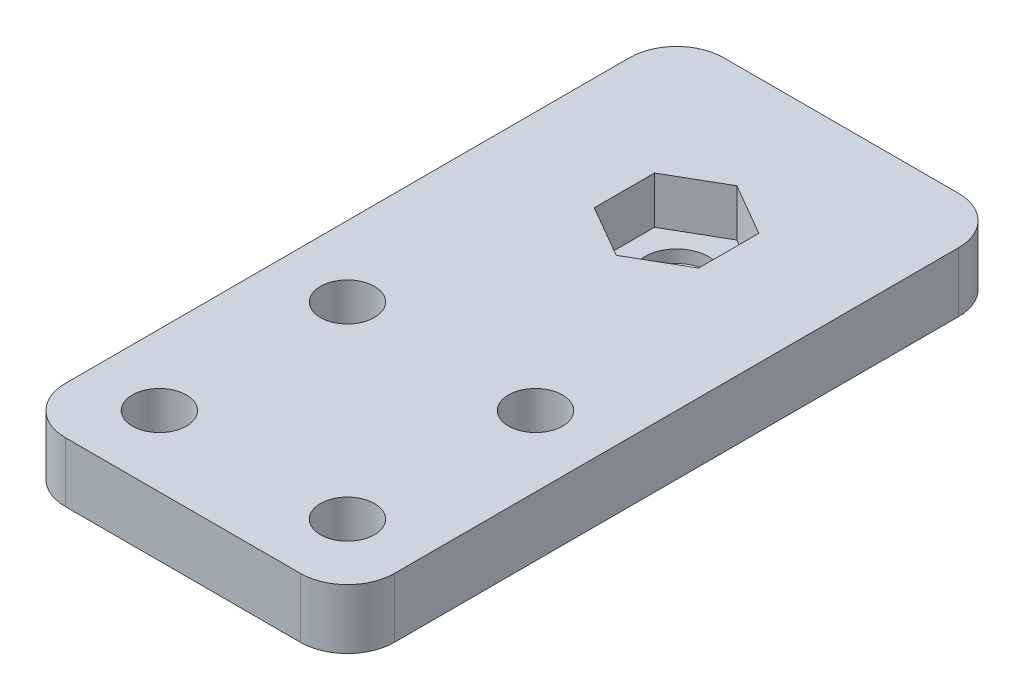
ISO-10303-21;
HEADER;
FILE_DESCRIPTION(('STEP AP214'),'2;1');
FILE_NAME('part.step','',(''),(''),'','','');
FILE_SCHEMA(('AUTOMOTIVE_DESIGN { 1 0 10303 214 1 1 1 1 }'));
ENDSEC;
DATA;
#1=APPLICATION_CONTEXT('core data for automotive mechanical design processes');
#2=APPLICATION_PROTOCOL_DEFINITION('international standard','automotive_design',2000,#1);
#3=PRODUCT_CONTEXT('',#1,'mechanical');
#4=PRODUCT('Part','Part','',(#3));
#5=PRODUCT_RELATED_PRODUCT_CATEGORY('part','',(#4));
#6=PRODUCT_DEFINITION_FORMATION('','',#4);
#7=PRODUCT_DEFINITION_CONTEXT('part definition',#1,'design');
#8=PRODUCT_DEFINITION('design','',#6,#7);
#9=PRODUCT_DEFINITION_SHAPE('','',#8);
#10=(LENGTH_UNIT() NAMED_UNIT(*) SI_UNIT(.MILLI.,.METRE.));
#11=(NAMED_UNIT(*) PLANE_ANGLE_UNIT() SI_UNIT($,.RADIAN.));
#12=(NAMED_UNIT(*) SI_UNIT($,.STERADIAN.) SOLID_ANGLE_UNIT());
#13=UNCERTAINTY_MEASURE_WITH_UNIT(LENGTH_MEASURE(1.E-05),#10,'distance_accuracy_value','');
#14=(GEOMETRIC_REPRESENTATION_CONTEXT(3) GLOBAL_UNCERTAINTY_ASSIGNED_CONTEXT((#13)) GLOBAL_UNIT_ASSIGNED_CONTEXT((#10,
#11,#12)) REPRESENTATION_CONTEXT('',''));
#15=CARTESIAN_POINT('',(0.,0.,0.));
#16=DIRECTION('',(0.,0.,1.));
#17=DIRECTION('',(1.,0.,0.));
#18=AXIS2_PLACEMENT_3D('',#15,#16,#17);
#19=CARTESIAN_POINT('',(-5.5499,6.35,-49.29564827097));
#20=DIRECTION('',(-0.500000000000017,0.,0.866025403784429));
#21=DIRECTION('',(0.866025403784429,0.,0.500000000000017));
#22=AXIS2_PLACEMENT_3D('',#19,#20,#21);
#23=PLANE('',#22);
#24=DIRECTION('',(0.866025403784811,0.,0.499999999999356));
#25=VECTOR('',#24,1.);
#26=CARTESIAN_POINT('',(-5.5499,1.35,-49.29564827097));
#27=LINE('',#26,#25);
#28=CARTESIAN_POINT('',(-5.5499,1.35,-49.29564827097));
#29=VERTEX_POINT('',#28);
#30=CARTESIAN_POINT('',(-1.22151637763079E-12,1.35,-46.0914120119979));
#31=VERTEX_POINT('',#30);
#32=EDGE_CURVE('E315',#29,#31,#27,.T.);
#33=ORIENTED_EDGE('',*,*,#32,.F.);
#34=DIRECTION('',(0.,1.,0.));
#35=VECTOR('',#34,1.);
#36=CARTESIAN_POINT('',(-5.5499,6.35,-49.29564827097));
#37=LINE('',#36,#35);
#38=CARTESIAN_POINT('',(-5.5499,6.35,-49.29564827097));
#39=VERTEX_POINT('',#38);
#40=EDGE_CURVE('E216',#29,#39,#37,.T.);
#41=ORIENTED_EDGE('',*,*,#40,.T.);
#42=DIRECTION('',(-0.866025403784811,0.,-0.499999999999356));
#43=VECTOR('',#42,1.);
#44=CARTESIAN_POINT('',(0.,6.35,-46.091412012));
#45=LINE('',#44,#43);
#46=CARTESIAN_POINT('',(-1.22155381507344E-12,6.35,-46.0914120119979));
#47=VERTEX_POINT('',#46);
#48=EDGE_CURVE('E310',#47,#39,#45,.T.);
#49=ORIENTED_EDGE('',*,*,#48,.F.);
#50=DIRECTION('',(0.,1.,0.));
#51=VECTOR('',#50,1.);
#52=CARTESIAN_POINT('',(0.,6.35,-46.091412012));
#53=LINE('',#52,#51);
#54=EDGE_CURVE('E162',#47,#31,#53,.F.);
#55=ORIENTED_EDGE('',*,*,#54,.T.);
#56=EDGE_LOOP('',(#33,#41,#49,#55));
#57=FACE_BOUND('',#56,.T.);
#58=ADVANCED_FACE('F17',(#57),#23,.F.);
#59=CARTESIAN_POINT('',(-5.5499,6.35,-55.70435172903));
#60=DIRECTION('',(-1.,0.,0.));
#61=DIRECTION('',(0.,0.,1.));
#62=AXIS2_PLACEMENT_3D('',#59,#60,#61);
#63=PLANE('',#62);
#64=DIRECTION('',(0.,0.,1.));
#65=VECTOR('',#64,1.);
#66=CARTESIAN_POINT('',(-5.5499,1.35,0.));
#67=LINE('',#66,#65);
#68=CARTESIAN_POINT('',(-5.54989999999878,1.35,-55.7043517290279));
#69=VERTEX_POINT('',#68);
#70=EDGE_CURVE('E184',#69,#29,#67,.T.);
#71=ORIENTED_EDGE('',*,*,#70,.F.);
#72=DIRECTION('',(0.,1.,0.));
#73=VECTOR('',#72,1.);
#74=CARTESIAN_POINT('',(-5.54989999999756,6.35,-55.7043517290258));
#75=LINE('',#74,#73);
#76=CARTESIAN_POINT('',(-5.54989999999939,6.35,-55.704351729029));
#77=VERTEX_POINT('',#76);
#78=EDGE_CURVE('E212',#69,#77,#75,.T.);
#79=ORIENTED_EDGE('',*,*,#78,.T.);
#80=DIRECTION('',(0.,0.,1.));
#81=VECTOR('',#80,1.);
#82=CARTESIAN_POINT('',(-5.5499,6.35,0.));
#83=LINE('',#82,#81);
#84=EDGE_CURVE('E307',#39,#77,#83,.F.);
#85=ORIENTED_EDGE('',*,*,#84,.F.);
#86=ORIENTED_EDGE('',*,*,#40,.F.);
#87=EDGE_LOOP('',(#71,#79,#85,#86));
#88=FACE_BOUND('',#87,.T.);
#89=ADVANCED_FACE('F331',(#88),#63,.F.);
#90=CARTESIAN_POINT('',(0.,6.35,-58.908587988));
#91=DIRECTION('',(-0.500000000000017,0.,-0.866025403784429));
#92=DIRECTION('',(-0.866025403784429,0.,0.500000000000017));
#93=AXIS2_PLACEMENT_3D('',#90,#91,#92);
#94=PLANE('',#93);
#95=DIRECTION('',(-0.866025403784811,0.,0.499999999999356));
#96=VECTOR('',#95,1.);
#97=CARTESIAN_POINT('',(0.,1.35,-58.908587988));
#98=LINE('',#97,#96);
#99=CARTESIAN_POINT('',(1.22151637763079E-12,1.35,-58.9085879880021));
#100=VERTEX_POINT('',#99);
#101=EDGE_CURVE('E180',#100,#69,#98,.T.);
#102=ORIENTED_EDGE('',*,*,#101,.F.);
#103=DIRECTION('',(0.,1.,0.));
#104=VECTOR('',#103,1.);
#105=CARTESIAN_POINT('',(2.44422537765132E-12,6.35,-58.9085879880042));
#106=LINE('',#105,#104);
#107=CARTESIAN_POINT('',(6.11327394955952E-13,6.35,-58.9085879880011));
#108=VERTEX_POINT('',#107);
#109=EDGE_CURVE('E163',#100,#108,#106,.T.);
#110=ORIENTED_EDGE('',*,*,#109,.T.);
#111=DIRECTION('',(0.866025403784811,0.,-0.499999999999356));
#112=VECTOR('',#111,1.);
#113=CARTESIAN_POINT('',(-5.5499,6.35,-55.70435172903));
#114=LINE('',#113,#112);
#115=EDGE_CURVE('E304',#77,#108,#114,.T.);
#116=ORIENTED_EDGE('',*,*,#115,.F.);
#117=ORIENTED_EDGE('',*,*,#78,.F.);
#118=EDGE_LOOP('',(#102,#110,#116,#117));
#119=FACE_BOUND('',#118,.T.);
#120=ADVANCED_FACE('F333',(#119),#94,.F.);
#121=CARTESIAN_POINT('',(5.5499,6.35,-55.70435172903));
#122=DIRECTION('',(0.500000000000017,0.,-0.866025403784429));
#123=DIRECTION('',(-0.866025403784429,0.,-0.500000000000017));
#124=AXIS2_PLACEMENT_3D('',#121,#122,#123);
#125=PLANE('',#124);
#126=DIRECTION('',(-0.866025403784811,0.,-0.499999999999356));
#127=VECTOR('',#126,1.);
#128=CARTESIAN_POINT('',(5.5499,1.35,-55.70435172903));
#129=LINE('',#128,#127);
#130=CARTESIAN_POINT('',(5.5499,1.35,-55.70435172903));
#131=VERTEX_POINT('',#130);
#132=EDGE_CURVE('E170',#131,#100,#129,.T.);
#133=ORIENTED_EDGE('',*,*,#132,.F.);
#134=DIRECTION('',(0.,1.,0.));
#135=VECTOR('',#134,1.);
#136=CARTESIAN_POINT('',(5.5499,6.35,-55.70435172903));
#137=LINE('',#136,#135);
#138=CARTESIAN_POINT('',(5.5499,6.35,-55.70435172903));
#139=VERTEX_POINT('',#138);
#140=EDGE_CURVE('E154',#131,#139,#137,.T.);
#141=ORIENTED_EDGE('',*,*,#140,.T.);
#142=DIRECTION('',(0.866025403784811,0.,0.499999999999356));
#143=VECTOR('',#142,1.);
#144=CARTESIAN_POINT('',(0.,6.35,-58.908587988));
#145=LINE('',#144,#143);
#146=EDGE_CURVE('E301',#108,#139,#145,.T.);
#147=ORIENTED_EDGE('',*,*,#146,.F.);
#148=ORIENTED_EDGE('',*,*,#109,.F.);
#149=EDGE_LOOP('',(#133,#141,#147,#148));
#150=FACE_BOUND('',#149,.T.);
#151=ADVANCED_FACE('F177',(#150),#125,.F.);
#152=CARTESIAN_POINT('',(5.5499,6.35,-49.29564827097));
#153=DIRECTION('',(1.,0.,0.));
#154=DIRECTION('',(0.,0.,-1.));
#155=AXIS2_PLACEMENT_3D('',#152,#153,#154);
#156=PLANE('',#155);
#157=DIRECTION('',(0.,0.,1.));
#158=VECTOR('',#157,1.);
#159=CARTESIAN_POINT('',(5.5499,1.35,0.));
#160=LINE('',#159,#158);
#161=CARTESIAN_POINT('',(5.54989999999939,1.35,-49.2956482709711));
#162=VERTEX_POINT('',#161);
#163=EDGE_CURVE('E157',#162,#131,#160,.F.);
#164=ORIENTED_EDGE('',*,*,#163,.F.);
#165=DIRECTION('',(0.,1.,0.));
#166=VECTOR('',#165,1.);
#167=CARTESIAN_POINT('',(5.54989999999756,6.35,-49.2956482709742));
#168=LINE('',#167,#166);
#169=CARTESIAN_POINT('',(5.54989999999939,6.35,-49.2956482709711));
#170=VERTEX_POINT('',#169);
#171=EDGE_CURVE('E175',#162,#170,#168,.T.);
#172=ORIENTED_EDGE('',*,*,#171,.T.);
#173=DIRECTION('',(0.,0.,1.));
#174=VECTOR('',#173,1.);
#175=CARTESIAN_POINT('',(5.5499,6.35,0.));
#176=LINE('',#175,#174);
#177=EDGE_CURVE('E109',#139,#170,#176,.T.);
#178=ORIENTED_EDGE('',*,*,#177,.F.);
#179=ORIENTED_EDGE('',*,*,#140,.F.);
#180=EDGE_LOOP('',(#164,#172,#178,#179));
#181=FACE_BOUND('',#180,.T.);
#182=ADVANCED_FACE('F156',(#181),#156,.F.);
#183=CARTESIAN_POINT('',(0.,6.35,-46.091412012));
#184=DIRECTION('',(0.500000000000017,0.,0.866025403784429));
#185=DIRECTION('',(0.866025403784429,0.,-0.500000000000017));
#186=AXIS2_PLACEMENT_3D('',#183,#184,#185);
#187=PLANE('',#186);
#188=DIRECTION('',(0.866025403784811,0.,-0.499999999999356));
#189=VECTOR('',#188,1.);
#190=CARTESIAN_POINT('',(0.,1.35,-46.091412012));
#191=LINE('',#190,#189);
#192=EDGE_CURVE('E173',#31,#162,#191,.T.);
#193=ORIENTED_EDGE('',*,*,#192,.F.);
#194=ORIENTED_EDGE('',*,*,#54,.F.);
#195=DIRECTION('',(-0.866025403784811,0.,0.499999999999356));
#196=VECTOR('',#195,1.);
#197=CARTESIAN_POINT('',(5.5499,6.35,-49.29564827097));
#198=LINE('',#197,#196);
#199=EDGE_CURVE('E296',#170,#47,#198,.T.);
#200=ORIENTED_EDGE('',*,*,#199,.F.);
#201=ORIENTED_EDGE('',*,*,#171,.F.);
#202=EDGE_LOOP('',(#193,#194,#200,#201));
#203=FACE_BOUND('',#202,.T.);
#204=ADVANCED_FACE('F327',(#203),#187,.F.);
#205=CARTESIAN_POINT('',(0.,1.35,0.));
#206=DIRECTION('',(0.,1.,0.));
#207=DIRECTION('',(0.,0.,1.));
#208=AXIS2_PLACEMENT_3D('',#205,#206,#207);
#209=PLANE('',#208);
#210=CARTESIAN_POINT('',(0.,1.35,-52.5));
#211=DIRECTION('',(0.,-1.,0.));
#212=DIRECTION('',(0.,0.,-1.));
#213=AXIS2_PLACEMENT_3D('',#210,#211,#212);
#214=CIRCLE('',#213,3.375);
#215=CARTESIAN_POINT('',(0.,1.35,-55.875));
#216=VERTEX_POINT('',#215);
#217=EDGE_CURVE('E259',#216,#216,#214,.T.);
#218=ORIENTED_EDGE('',*,*,#217,.T.);
#219=EDGE_LOOP('',(#218));
#220=FACE_BOUND('',#219,.T.);
#221=ORIENTED_EDGE('',*,*,#32,.T.);
#222=ORIENTED_EDGE('',*,*,#192,.T.);
#223=ORIENTED_EDGE('',*,*,#163,.T.);
#224=ORIENTED_EDGE('',*,*,#132,.T.);
#225=ORIENTED_EDGE('',*,*,#101,.T.);
#226=ORIENTED_EDGE('',*,*,#70,.T.);
#227=EDGE_LOOP('',(#221,#222,#223,#224,#225,#226));
#228=FACE_BOUND('',#227,.T.);
#229=ADVANCED_FACE('F168',(#220,#228),#209,.T.);
#230=CARTESIAN_POINT('',(0.,6.35,0.));
#231=DIRECTION('',(0.,1.,0.));
#232=DIRECTION('',(0.,0.,1.));
#233=AXIS2_PLACEMENT_3D('',#230,#231,#232);
#234=PLANE('',#233);
#235=ORIENTED_EDGE('',*,*,#177,.T.);
#236=ORIENTED_EDGE('',*,*,#199,.T.);
#237=ORIENTED_EDGE('',*,*,#48,.T.);
#238=ORIENTED_EDGE('',*,*,#84,.T.);
#239=ORIENTED_EDGE('',*,*,#115,.T.);
#240=ORIENTED_EDGE('',*,*,#146,.T.);
#241=EDGE_LOOP('',(#235,#236,#237,#238,#239,#240));
#242=FACE_BOUND('',#241,.T.);
#243=CARTESIAN_POINT('',(10.,6.35,-7.5));
#244=DIRECTION('',(0.,-1.,0.));
#245=DIRECTION('',(0.,0.,-1.));
#246=AXIS2_PLACEMENT_3D('',#243,#244,#245);
#247=CIRCLE('',#246,2.875);
#248=CARTESIAN_POINT('',(10.,6.35,-10.375));
#249=VERTEX_POINT('',#248);
#250=EDGE_CURVE('E255',#249,#249,#247,.T.);
#251=ORIENTED_EDGE('',*,*,#250,.T.);
#252=EDGE_LOOP('',(#251));
#253=FACE_BOUND('',#252,.T.);
#254=CARTESIAN_POINT('',(-10.,6.35,-27.5));
#255=DIRECTION('',(0.,-1.,0.));
#256=DIRECTION('',(0.,0.,-1.));
#257=AXIS2_PLACEMENT_3D('',#254,#255,#256);
#258=CIRCLE('',#257,2.875);
#259=CARTESIAN_POINT('',(-10.,6.35,-30.375));
#260=VERTEX_POINT('',#259);
#261=EDGE_CURVE('E263',#260,#260,#258,.T.);
#262=ORIENTED_EDGE('',*,*,#261,.T.);
#263=EDGE_LOOP('',(#262));
#264=FACE_BOUND('',#263,.T.);
#265=CARTESIAN_POINT('',(-10.,6.35,-7.5));
#266=DIRECTION('',(0.,-1.,0.));
#267=DIRECTION('',(0.,0.,-1.));
#268=AXIS2_PLACEMENT_3D('',#265,#266,#267);
#269=CIRCLE('',#268,2.875);
#270=CARTESIAN_POINT('',(-10.,6.35,-10.375));
#271=VERTEX_POINT('',#270);
#272=EDGE_CURVE('E267',#271,#271,#269,.T.);
#273=ORIENTED_EDGE('',*,*,#272,.T.);
#274=EDGE_LOOP('',(#273));
#275=FACE_BOUND('',#274,.T.);
#276=CARTESIAN_POINT('',(10.,6.35,-27.5));
#277=DIRECTION('',(0.,-1.,0.));
#278=DIRECTION('',(0.,0.,-1.));
#279=AXIS2_PLACEMENT_3D('',#276,#277,#278);
#280=CIRCLE('',#279,2.875);
#281=CARTESIAN_POINT('',(10.,6.35,-30.375));
#282=VERTEX_POINT('',#281);
#283=EDGE_CURVE('E271',#282,#282,#280,.T.);
#284=ORIENTED_EDGE('',*,*,#283,.T.);
#285=EDGE_LOOP('',(#284));
#286=FACE_BOUND('',#285,.T.);
#287=DIRECTION('',(1.,0.,0.));
#288=VECTOR('',#287,1.);
#289=CARTESIAN_POINT('',(-17.5,6.35,0.));
#290=LINE('',#289,#288);
#291=CARTESIAN_POINT('',(12.5,6.35,0.));
#292=VERTEX_POINT('',#291);
#293=CARTESIAN_POINT('',(-12.5,6.35,0.));
#294=VERTEX_POINT('',#293);
#295=EDGE_CURVE('E188',#292,#294,#290,.F.);
#296=ORIENTED_EDGE('',*,*,#295,.F.);
#297=CARTESIAN_POINT('',(12.5,6.35,-5.));
#298=DIRECTION('',(0.,-1.,0.));
#299=DIRECTION('',(0.,0.,-1.));
#300=AXIS2_PLACEMENT_3D('',#297,#298,#299);
#301=CIRCLE('',#300,5.);
#302=CARTESIAN_POINT('',(17.5,6.35,-5.));
#303=VERTEX_POINT('',#302);
#304=EDGE_CURVE('E20',#303,#292,#301,.T.);
#305=ORIENTED_EDGE('',*,*,#304,.F.);
#306=DIRECTION('',(0.,0.,-1.));
#307=VECTOR('',#306,1.);
#308=CARTESIAN_POINT('',(17.5,6.35,0.));
#309=LINE('',#308,#307);
#310=CARTESIAN_POINT('',(17.5,6.35,-65.));
#311=VERTEX_POINT('',#310);
#312=EDGE_CURVE('E98',#311,#303,#309,.F.);
#313=ORIENTED_EDGE('',*,*,#312,.F.);
#314=CARTESIAN_POINT('',(12.5,6.35,-65.));
#315=DIRECTION('',(0.,-1.,0.));
#316=DIRECTION('',(0.,0.,-1.));
#317=AXIS2_PLACEMENT_3D('',#314,#315,#316);
#318=CIRCLE('',#317,5.);
#319=CARTESIAN_POINT('',(12.5,6.35,-70.));
#320=VERTEX_POINT('',#319);
#321=EDGE_CURVE('E281',#320,#311,#318,.T.);
#322=ORIENTED_EDGE('',*,*,#321,.F.);
#323=DIRECTION('',(-1.,0.,0.));
#324=VECTOR('',#323,1.);
#325=CARTESIAN_POINT('',(17.5,6.35,-70.));
#326=LINE('',#325,#324);
#327=CARTESIAN_POINT('',(-12.5,6.35,-70.));
#328=VERTEX_POINT('',#327);
#329=EDGE_CURVE('E197',#328,#320,#326,.F.);
#330=ORIENTED_EDGE('',*,*,#329,.F.);
#331=CARTESIAN_POINT('',(-12.5,6.35,-65.));
#332=DIRECTION('',(0.,-1.,0.));
#333=DIRECTION('',(0.,0.,-1.));
#334=AXIS2_PLACEMENT_3D('',#331,#332,#333);
#335=CIRCLE('',#334,5.);
#336=CARTESIAN_POINT('',(-17.5,6.35,-65.));
#337=VERTEX_POINT('',#336);
#338=EDGE_CURVE('E279',#337,#328,#335,.T.);
#339=ORIENTED_EDGE('',*,*,#338,.F.);
#340=DIRECTION('',(0.,0.,1.));
#341=VECTOR('',#340,1.);
#342=CARTESIAN_POINT('',(-17.5,6.35,-70.));
#343=LINE('',#342,#341);
#344=CARTESIAN_POINT('',(-17.5,6.35,-5.));
#345=VERTEX_POINT('',#344);
#346=EDGE_CURVE('E192',#345,#337,#343,.F.);
#347=ORIENTED_EDGE('',*,*,#346,.F.);
#348=CARTESIAN_POINT('',(-12.5,6.35,-5.));
#349=DIRECTION('',(0.,-1.,0.));
#350=DIRECTION('',(0.,0.,-1.));
#351=AXIS2_PLACEMENT_3D('',#348,#349,#350);
#352=CIRCLE('',#351,5.);
#353=EDGE_CURVE('E276',#294,#345,#352,.T.);
#354=ORIENTED_EDGE('',*,*,#353,.F.);
#355=EDGE_LOOP('',(#296,#305,#313,#322,#330,#339,#347,#354));
#356=FACE_BOUND('',#355,.T.);
#357=ADVANCED_FACE('F328',(#242,#253,#264,#275,#286,#356),#234,.T.);
#358=CARTESIAN_POINT('',(12.5,14.62786,-5.));
#359=DIRECTION('',(0.,-1.,0.));
#360=DIRECTION('',(0.,0.,-1.));
#361=AXIS2_PLACEMENT_3D('',#358,#359,#360);
#362=CYLINDRICAL_SURFACE('',#361,5.);
#363=DIRECTION('',(0.,1.,0.));
#364=VECTOR('',#363,1.);
#365=CARTESIAN_POINT('',(12.5,0.,0.));
#366=LINE('',#365,#364);
#367=CARTESIAN_POINT('',(12.5,0.,0.));
#368=VERTEX_POINT('',#367);
#369=EDGE_CURVE('E275',#368,#292,#366,.T.);
#370=ORIENTED_EDGE('',*,*,#369,.F.);
#371=CARTESIAN_POINT('',(12.5,0.,-5.));
#372=DIRECTION('',(0.,-1.,0.));
#373=DIRECTION('',(0.,0.,-1.));
#374=AXIS2_PLACEMENT_3D('',#371,#372,#373);
#375=CIRCLE('',#374,5.);
#376=CARTESIAN_POINT('',(17.5,0.,-5.));
#377=VERTEX_POINT('',#376);
#378=EDGE_CURVE('E251',#368,#377,#375,.F.);
#379=ORIENTED_EDGE('',*,*,#378,.T.);
#380=DIRECTION('',(0.,1.,0.));
#381=VECTOR('',#380,1.);
#382=CARTESIAN_POINT('',(17.5,0.,-5.));
#383=LINE('',#382,#381);
#384=EDGE_CURVE('E204',#303,#377,#383,.F.);
#385=ORIENTED_EDGE('',*,*,#384,.F.);
#386=ORIENTED_EDGE('',*,*,#304,.T.);
#387=EDGE_LOOP('',(#370,#379,#385,#386));
#388=FACE_BOUND('',#387,.T.);
#389=ADVANCED_FACE('F397',(#388),#362,.T.);
#390=CARTESIAN_POINT('',(17.5,0.,0.));
#391=DIRECTION('',(1.,0.,0.));
#392=DIRECTION('',(0.,0.,-1.));
#393=AXIS2_PLACEMENT_3D('',#390,#391,#392);
#394=PLANE('',#393);
#395=ORIENTED_EDGE('',*,*,#312,.T.);
#396=ORIENTED_EDGE('',*,*,#384,.T.);
#397=DIRECTION('',(0.,0.,1.));
#398=VECTOR('',#397,1.);
#399=CARTESIAN_POINT('',(17.5,0.,0.));
#400=LINE('',#399,#398);
#401=CARTESIAN_POINT('',(17.5,0.,-65.));
#402=VERTEX_POINT('',#401);
#403=EDGE_CURVE('E250',#377,#402,#400,.F.);
#404=ORIENTED_EDGE('',*,*,#403,.T.);
#405=DIRECTION('',(0.,-1.,0.));
#406=VECTOR('',#405,1.);
#407=CARTESIAN_POINT('',(17.5,14.62786,-65.));
#408=LINE('',#407,#406);
#409=EDGE_CURVE('E201',#311,#402,#408,.T.);
#410=ORIENTED_EDGE('',*,*,#409,.F.);
#411=EDGE_LOOP('',(#395,#396,#404,#410));
#412=FACE_BOUND('',#411,.T.);
#413=ADVANCED_FACE('F395',(#412),#394,.T.);
#414=CARTESIAN_POINT('',(12.5,14.62786,-65.));
#415=DIRECTION('',(0.,-1.,0.));
#416=DIRECTION('',(0.,0.,-1.));
#417=AXIS2_PLACEMENT_3D('',#414,#415,#416);
#418=CYLINDRICAL_SURFACE('',#417,5.);
#419=ORIENTED_EDGE('',*,*,#409,.T.);
#420=CARTESIAN_POINT('',(12.5,0.,-65.));
#421=DIRECTION('',(0.,-1.,0.));
#422=DIRECTION('',(0.,0.,-1.));
#423=AXIS2_PLACEMENT_3D('',#420,#421,#422);
#424=CIRCLE('',#423,5.);
#425=CARTESIAN_POINT('',(12.5,0.,-70.));
#426=VERTEX_POINT('',#425);
#427=EDGE_CURVE('E246',#402,#426,#424,.F.);
#428=ORIENTED_EDGE('',*,*,#427,.T.);
#429=DIRECTION('',(0.,1.,0.));
#430=VECTOR('',#429,1.);
#431=CARTESIAN_POINT('',(12.5,0.,-70.));
#432=LINE('',#431,#430);
#433=EDGE_CURVE('E200',#320,#426,#432,.F.);
#434=ORIENTED_EDGE('',*,*,#433,.F.);
#435=ORIENTED_EDGE('',*,*,#321,.T.);
#436=EDGE_LOOP('',(#419,#428,#434,#435));
#437=FACE_BOUND('',#436,.T.);
#438=ADVANCED_FACE('F391',(#437),#418,.T.);
#439=CARTESIAN_POINT('',(17.5,0.,-70.));
#440=DIRECTION('',(0.,0.,-1.));
#441=DIRECTION('',(-1.,0.,0.));
#442=AXIS2_PLACEMENT_3D('',#439,#440,#441);
#443=PLANE('',#442);
#444=ORIENTED_EDGE('',*,*,#329,.T.);
#445=ORIENTED_EDGE('',*,*,#433,.T.);
#446=DIRECTION('',(1.,0.,0.));
#447=VECTOR('',#446,1.);
#448=CARTESIAN_POINT('',(0.,0.,-70.));
#449=LINE('',#448,#447);
#450=CARTESIAN_POINT('',(-12.5,0.,-70.));
#451=VERTEX_POINT('',#450);
#452=EDGE_CURVE('E245',#426,#451,#449,.F.);
#453=ORIENTED_EDGE('',*,*,#452,.T.);
#454=DIRECTION('',(0.,-1.,0.));
#455=VECTOR('',#454,1.);
#456=CARTESIAN_POINT('',(-12.5,14.62786,-70.));
#457=LINE('',#456,#455);
#458=EDGE_CURVE('E196',#328,#451,#457,.T.);
#459=ORIENTED_EDGE('',*,*,#458,.F.);
#460=EDGE_LOOP('',(#444,#445,#453,#459));
#461=FACE_BOUND('',#460,.T.);
#462=ADVANCED_FACE('F387',(#461),#443,.T.);
#463=CARTESIAN_POINT('',(-12.5,14.62786,-65.));
#464=DIRECTION('',(0.,-1.,0.));
#465=DIRECTION('',(0.,0.,-1.));
#466=AXIS2_PLACEMENT_3D('',#463,#464,#465);
#467=CYLINDRICAL_SURFACE('',#466,5.);
#468=ORIENTED_EDGE('',*,*,#458,.T.);
#469=CARTESIAN_POINT('',(-12.5,0.,-65.));
#470=DIRECTION('',(0.,-1.,0.));
#471=DIRECTION('',(0.,0.,-1.));
#472=AXIS2_PLACEMENT_3D('',#469,#470,#471);
#473=CIRCLE('',#472,5.);
#474=CARTESIAN_POINT('',(-17.5,0.,-65.));
#475=VERTEX_POINT('',#474);
#476=EDGE_CURVE('E241',#451,#475,#473,.F.);
#477=ORIENTED_EDGE('',*,*,#476,.T.);
#478=DIRECTION('',(0.,1.,0.));
#479=VECTOR('',#478,1.);
#480=CARTESIAN_POINT('',(-17.5,0.,-65.));
#481=LINE('',#480,#479);
#482=EDGE_CURVE('E195',#337,#475,#481,.F.);
#483=ORIENTED_EDGE('',*,*,#482,.F.);
#484=ORIENTED_EDGE('',*,*,#338,.T.);
#485=EDGE_LOOP('',(#468,#477,#483,#484));
#486=FACE_BOUND('',#485,.T.);
#487=ADVANCED_FACE('F383',(#486),#467,.T.);
#488=CARTESIAN_POINT('',(-17.5,0.,-70.));
#489=DIRECTION('',(-1.,0.,0.));
#490=DIRECTION('',(0.,0.,1.));
#491=AXIS2_PLACEMENT_3D('',#488,#489,#490);
#492=PLANE('',#491);
#493=DIRECTION('',(0.,0.,1.));
#494=VECTOR('',#493,1.);
#495=CARTESIAN_POINT('',(-17.5,0.,0.));
#496=LINE('',#495,#494);
#497=CARTESIAN_POINT('',(-17.5,0.,-5.));
#498=VERTEX_POINT('',#497);
#499=EDGE_CURVE('E240',#475,#498,#496,.T.);
#500=ORIENTED_EDGE('',*,*,#499,.T.);
#501=DIRECTION('',(0.,-1.,0.));
#502=VECTOR('',#501,1.);
#503=CARTESIAN_POINT('',(-17.5,14.62786,-5.));
#504=LINE('',#503,#502);
#505=EDGE_CURVE('E191',#345,#498,#504,.T.);
#506=ORIENTED_EDGE('',*,*,#505,.F.);
#507=ORIENTED_EDGE('',*,*,#346,.T.);
#508=ORIENTED_EDGE('',*,*,#482,.T.);
#509=EDGE_LOOP('',(#500,#506,#507,#508));
#510=FACE_BOUND('',#509,.T.);
#511=ADVANCED_FACE('F379',(#510),#492,.T.);
#512=CARTESIAN_POINT('',(-12.5,14.62786,-5.));
#513=DIRECTION('',(0.,-1.,0.));
#514=DIRECTION('',(0.,0.,-1.));
#515=AXIS2_PLACEMENT_3D('',#512,#513,#514);
#516=CYLINDRICAL_SURFACE('',#515,5.);
#517=ORIENTED_EDGE('',*,*,#505,.T.);
#518=CARTESIAN_POINT('',(-12.5,0.,-5.));
#519=DIRECTION('',(0.,-1.,0.));
#520=DIRECTION('',(0.,0.,-1.));
#521=AXIS2_PLACEMENT_3D('',#518,#519,#520);
#522=CIRCLE('',#521,5.);
#523=CARTESIAN_POINT('',(-12.5,0.,0.));
#524=VERTEX_POINT('',#523);
#525=EDGE_CURVE('E236',#498,#524,#522,.F.);
#526=ORIENTED_EDGE('',*,*,#525,.T.);
#527=DIRECTION('',(0.,1.,0.));
#528=VECTOR('',#527,1.);
#529=CARTESIAN_POINT('',(-12.5,0.,0.));
#530=LINE('',#529,#528);
#531=EDGE_CURVE('E39',#294,#524,#530,.F.);
#532=ORIENTED_EDGE('',*,*,#531,.F.);
#533=ORIENTED_EDGE('',*,*,#353,.T.);
#534=EDGE_LOOP('',(#517,#526,#532,#533));
#535=FACE_BOUND('',#534,.T.);
#536=ADVANCED_FACE('F376',(#535),#516,.T.);
#537=CARTESIAN_POINT('',(-17.5,0.,0.));
#538=DIRECTION('',(0.,0.,1.));
#539=DIRECTION('',(1.,0.,0.));
#540=AXIS2_PLACEMENT_3D('',#537,#538,#539);
#541=PLANE('',#540);
#542=DIRECTION('',(1.,0.,0.));
#543=VECTOR('',#542,1.);
#544=CARTESIAN_POINT('',(0.,0.,0.));
#545=LINE('',#544,#543);
#546=EDGE_CURVE('E235',#524,#368,#545,.T.);
#547=ORIENTED_EDGE('',*,*,#546,.T.);
#548=ORIENTED_EDGE('',*,*,#369,.T.);
#549=ORIENTED_EDGE('',*,*,#295,.T.);
#550=ORIENTED_EDGE('',*,*,#531,.T.);
#551=EDGE_LOOP('',(#547,#548,#549,#550));
#552=FACE_BOUND('',#551,.T.);
#553=ADVANCED_FACE('F372',(#552),#541,.T.);
#554=CARTESIAN_POINT('',(10.,6.35,-27.5));
#555=DIRECTION('',(0.,-1.,0.));
#556=DIRECTION('',(0.,0.,-1.));
#557=AXIS2_PLACEMENT_3D('',#554,#555,#556);
#558=CYLINDRICAL_SURFACE('',#557,2.875);
#559=ORIENTED_EDGE('',*,*,#283,.F.);
#560=EDGE_LOOP('',(#559));
#561=FACE_BOUND('',#560,.T.);
#562=CARTESIAN_POINT('',(10.,0.,-27.5));
#563=DIRECTION('',(0.,-1.,0.));
#564=DIRECTION('',(0.,0.,-1.));
#565=AXIS2_PLACEMENT_3D('',#562,#563,#564);
#566=CIRCLE('',#565,2.875);
#567=CARTESIAN_POINT('',(10.,0.,-30.375));
#568=VERTEX_POINT('',#567);
#569=EDGE_CURVE('E231',#568,#568,#566,.T.);
#570=ORIENTED_EDGE('',*,*,#569,.T.);
#571=EDGE_LOOP('',(#570));
#572=FACE_BOUND('',#571,.T.);
#573=ADVANCED_FACE('F368',(#561,#572),#558,.F.);
#574=CARTESIAN_POINT('',(-10.,6.35,-7.5));
#575=DIRECTION('',(0.,-1.,0.));
#576=DIRECTION('',(0.,0.,-1.));
#577=AXIS2_PLACEMENT_3D('',#574,#575,#576);
#578=CYLINDRICAL_SURFACE('',#577,2.875);
#579=ORIENTED_EDGE('',*,*,#272,.F.);
#580=EDGE_LOOP('',(#579));
#581=FACE_BOUND('',#580,.T.);
#582=CARTESIAN_POINT('',(-10.,0.,-7.5));
#583=DIRECTION('',(0.,-1.,0.));
#584=DIRECTION('',(0.,0.,-1.));
#585=AXIS2_PLACEMENT_3D('',#582,#583,#584);
#586=CIRCLE('',#585,2.875);
#587=CARTESIAN_POINT('',(-10.,0.,-10.375));
#588=VERTEX_POINT('',#587);
#589=EDGE_CURVE('E227',#588,#588,#586,.T.);
#590=ORIENTED_EDGE('',*,*,#589,.T.);
#591=EDGE_LOOP('',(#590));
#592=FACE_BOUND('',#591,.T.);
#593=ADVANCED_FACE('F364',(#581,#592),#578,.F.);
#594=CARTESIAN_POINT('',(-10.,6.35,-27.5));
#595=DIRECTION('',(0.,-1.,0.));
#596=DIRECTION('',(0.,0.,-1.));
#597=AXIS2_PLACEMENT_3D('',#594,#595,#596);
#598=CYLINDRICAL_SURFACE('',#597,2.875);
#599=ORIENTED_EDGE('',*,*,#261,.F.);
#600=EDGE_LOOP('',(#599));
#601=FACE_BOUND('',#600,.T.);
#602=CARTESIAN_POINT('',(-10.,0.,-27.5));
#603=DIRECTION('',(0.,-1.,0.));
#604=DIRECTION('',(0.,0.,-1.));
#605=AXIS2_PLACEMENT_3D('',#602,#603,#604);
#606=CIRCLE('',#605,2.875);
#607=CARTESIAN_POINT('',(-10.,0.,-30.375));
#608=VERTEX_POINT('',#607);
#609=EDGE_CURVE('E223',#608,#608,#606,.T.);
#610=ORIENTED_EDGE('',*,*,#609,.T.);
#611=EDGE_LOOP('',(#610));
#612=FACE_BOUND('',#611,.T.);
#613=ADVANCED_FACE('F360',(#601,#612),#598,.F.);
#614=CARTESIAN_POINT('',(0.,6.35,-52.5));
#615=DIRECTION('',(0.,-1.,0.));
#616=DIRECTION('',(0.,0.,-1.));
#617=AXIS2_PLACEMENT_3D('',#614,#615,#616);
#618=CYLINDRICAL_SURFACE('',#617,3.375);
#619=CARTESIAN_POINT('',(0.,0.,-52.5));
#620=DIRECTION('',(0.,-1.,0.));
#621=DIRECTION('',(0.,0.,-1.));
#622=AXIS2_PLACEMENT_3D('',#619,#620,#621);
#623=CIRCLE('',#622,3.375);
#624=CARTESIAN_POINT('',(0.,0.,-55.875));
#625=VERTEX_POINT('',#624);
#626=EDGE_CURVE('E27',#625,#625,#623,.T.);
#627=ORIENTED_EDGE('',*,*,#626,.T.);
#628=EDGE_LOOP('',(#627));
#629=FACE_BOUND('',#628,.T.);
#630=ORIENTED_EDGE('',*,*,#217,.F.);
#631=EDGE_LOOP('',(#630));
#632=FACE_BOUND('',#631,.T.);
#633=ADVANCED_FACE('F352',(#629,#632),#618,.F.);
#634=CARTESIAN_POINT('',(10.,6.35,-7.5));
#635=DIRECTION('',(0.,-1.,0.));
#636=DIRECTION('',(0.,0.,-1.));
#637=AXIS2_PLACEMENT_3D('',#634,#635,#636);
#638=CYLINDRICAL_SURFACE('',#637,2.875);
#639=ORIENTED_EDGE('',*,*,#250,.F.);
#640=EDGE_LOOP('',(#639));
#641=FACE_BOUND('',#640,.T.);
#642=CARTESIAN_POINT('',(10.,0.,-7.5));
#643=DIRECTION('',(0.,-1.,0.));
#644=DIRECTION('',(0.,0.,-1.));
#645=AXIS2_PLACEMENT_3D('',#642,#643,#644);
#646=CIRCLE('',#645,2.875);
#647=CARTESIAN_POINT('',(10.,0.,-10.375));
#648=VERTEX_POINT('',#647);
#649=EDGE_CURVE('E11',#648,#648,#646,.T.);
#650=ORIENTED_EDGE('',*,*,#649,.T.);
#651=EDGE_LOOP('',(#650));
#652=FACE_BOUND('',#651,.T.);
#653=ADVANCED_FACE('F344',(#641,#652),#638,.F.);
#654=CARTESIAN_POINT('',(0.,0.,0.));
#655=DIRECTION('',(0.,1.,0.));
#656=DIRECTION('',(0.,0.,1.));
#657=AXIS2_PLACEMENT_3D('',#654,#655,#656);
#658=PLANE('',#657);
#659=ORIENTED_EDGE('',*,*,#649,.F.);
#660=EDGE_LOOP('',(#659));
#661=FACE_BOUND('',#660,.T.);
#662=ORIENTED_EDGE('',*,*,#626,.F.);
#663=EDGE_LOOP('',(#662));
#664=FACE_BOUND('',#663,.T.);
#665=ORIENTED_EDGE('',*,*,#609,.F.);
#666=EDGE_LOOP('',(#665));
#667=FACE_BOUND('',#666,.T.);
#668=ORIENTED_EDGE('',*,*,#589,.F.);
#669=EDGE_LOOP('',(#668));
#670=FACE_BOUND('',#669,.T.);
#671=ORIENTED_EDGE('',*,*,#569,.F.);
#672=EDGE_LOOP('',(#671));
#673=FACE_BOUND('',#672,.T.);
#674=ORIENTED_EDGE('',*,*,#525,.F.);
#675=ORIENTED_EDGE('',*,*,#499,.F.);
#676=ORIENTED_EDGE('',*,*,#476,.F.);
#677=ORIENTED_EDGE('',*,*,#452,.F.);
#678=ORIENTED_EDGE('',*,*,#427,.F.);
#679=ORIENTED_EDGE('',*,*,#403,.F.);
#680=ORIENTED_EDGE('',*,*,#378,.F.);
#681=ORIENTED_EDGE('',*,*,#546,.F.);
#682=EDGE_LOOP('',(#674,#675,#676,#677,#678,#679,#680,#681));
#683=FACE_BOUND('',#682,.T.);
#684=ADVANCED_FACE('F342',(#661,#664,#667,#670,#673,#683),#658,.F.);
#685=CLOSED_SHELL('',(#58,#89,#120,#151,#182,#204,#229,#357,#389,#413,#438,#462,#487,#511,#536,
#553,#573,#593,#613,#633,#653,#684));
#686=MANIFOLD_SOLID_BREP('B1',#685);
#687=ADVANCED_BREP_SHAPE_REPRESENTATION('',(#18,#686),#14);
#688=SHAPE_DEFINITION_REPRESENTATION(#9,#687);
ENDSEC;
END-ISO-10303-21;
